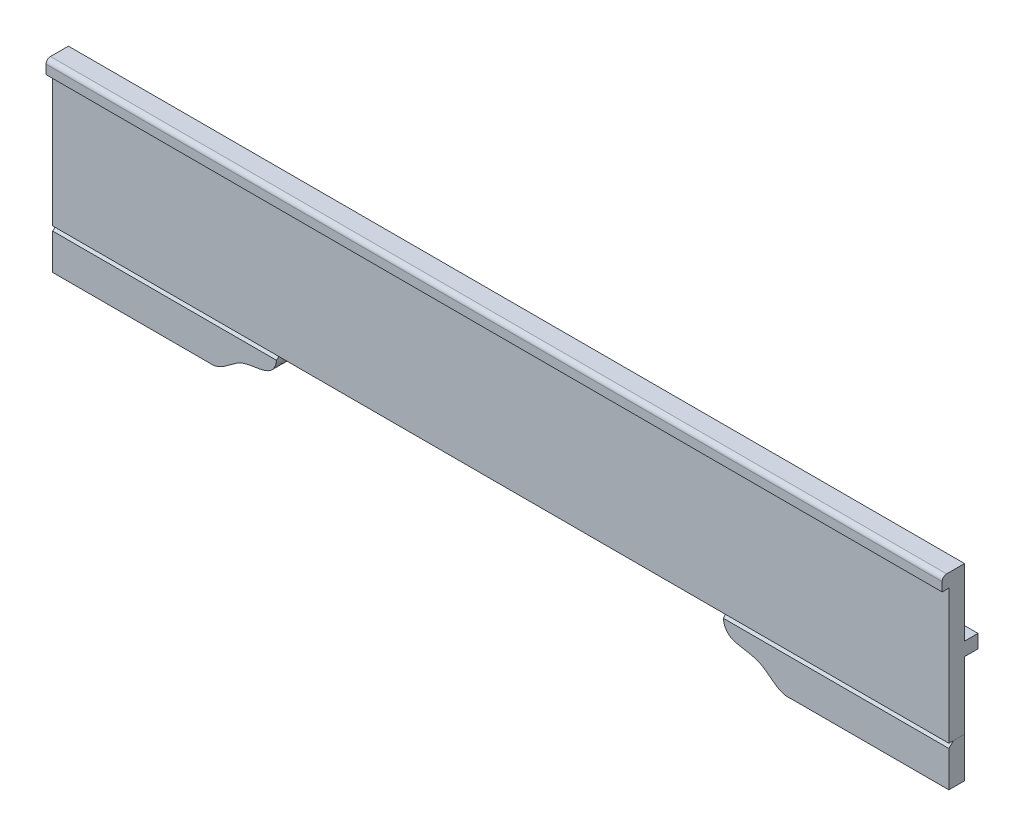
ISO-10303-21;
HEADER;
FILE_DESCRIPTION(('STEP AP214'),'2;1');
FILE_NAME('part.step','',(''),(''),'','','');
FILE_SCHEMA(('AUTOMOTIVE_DESIGN { 1 0 10303 214 1 1 1 1 }'));
ENDSEC;
DATA;
#1=APPLICATION_CONTEXT('core data for automotive mechanical design processes');
#2=APPLICATION_PROTOCOL_DEFINITION('international standard','automotive_design',2000,#1);
#3=PRODUCT_CONTEXT('',#1,'mechanical');
#4=PRODUCT('Part','Part','',(#3));
#5=PRODUCT_RELATED_PRODUCT_CATEGORY('part','',(#4));
#6=PRODUCT_DEFINITION_FORMATION('','',#4);
#7=PRODUCT_DEFINITION_CONTEXT('part definition',#1,'design');
#8=PRODUCT_DEFINITION('design','',#6,#7);
#9=PRODUCT_DEFINITION_SHAPE('','',#8);
#10=(LENGTH_UNIT() NAMED_UNIT(*) SI_UNIT(.MILLI.,.METRE.));
#11=(NAMED_UNIT(*) PLANE_ANGLE_UNIT() SI_UNIT($,.RADIAN.));
#12=(NAMED_UNIT(*) SI_UNIT($,.STERADIAN.) SOLID_ANGLE_UNIT());
#13=UNCERTAINTY_MEASURE_WITH_UNIT(LENGTH_MEASURE(1.E-05),#10,'distance_accuracy_value','');
#14=(GEOMETRIC_REPRESENTATION_CONTEXT(3) GLOBAL_UNCERTAINTY_ASSIGNED_CONTEXT((#13)) GLOBAL_UNIT_ASSIGNED_CONTEXT((#10,
#11,#12)) REPRESENTATION_CONTEXT('',''));
#15=CARTESIAN_POINT('',(0.,0.,0.));
#16=DIRECTION('',(0.,0.,1.));
#17=DIRECTION('',(1.,0.,0.));
#18=AXIS2_PLACEMENT_3D('',#15,#16,#17);
#19=CARTESIAN_POINT('',(0.,-330.,0.));
#20=DIRECTION('',(1.,0.,0.));
#21=DIRECTION('',(0.,1.,0.));
#22=AXIS2_PLACEMENT_3D('',#19,#20,#21);
#23=PLANE('',#22);
#24=DIRECTION('',(0.,0.,1.));
#25=VECTOR('',#24,1.);
#26=CARTESIAN_POINT('',(0.,-330.,0.));
#27=LINE('',#26,#25);
#28=CARTESIAN_POINT('',(0.,-330.,0.));
#29=VERTEX_POINT('',#28);
#30=CARTESIAN_POINT('',(0.,-330.,24.9999999999999));
#31=VERTEX_POINT('',#30);
#32=EDGE_CURVE('E96',#29,#31,#27,.T.);
#33=ORIENTED_EDGE('',*,*,#32,.T.);
#34=DIRECTION('',(0.,-0.707106781186544,0.707106781186551));
#35=VECTOR('',#34,1.);
#36=CARTESIAN_POINT('',(0.,-317.5,12.4999999999998));
#37=LINE('',#36,#35);
#38=CARTESIAN_POINT('',(0.,-340.,35.));
#39=VERTEX_POINT('',#38);
#40=EDGE_CURVE('E12',#31,#39,#37,.T.);
#41=ORIENTED_EDGE('',*,*,#40,.T.);
#42=DIRECTION('',(0.,1.,0.));
#43=VECTOR('',#42,1.);
#44=CARTESIAN_POINT('',(0.,-330.,35.));
#45=LINE('',#44,#43);
#46=CARTESIAN_POINT('',(0.,-420.,35.));
#47=VERTEX_POINT('',#46);
#48=EDGE_CURVE('E156',#47,#39,#45,.T.);
#49=ORIENTED_EDGE('',*,*,#48,.F.);
#50=DIRECTION('',(0.,0.,1.));
#51=VECTOR('',#50,1.);
#52=CARTESIAN_POINT('',(0.,-420.,0.));
#53=LINE('',#52,#51);
#54=CARTESIAN_POINT('',(0.,-420.,0.));
#55=VERTEX_POINT('',#54);
#56=EDGE_CURVE('E117',#55,#47,#53,.T.);
#57=ORIENTED_EDGE('',*,*,#56,.F.);
#58=DIRECTION('',(0.,1.,0.));
#59=VECTOR('',#58,1.);
#60=CARTESIAN_POINT('',(0.,-330.,0.));
#61=LINE('',#60,#59);
#62=EDGE_CURVE('E111',#55,#29,#61,.T.);
#63=ORIENTED_EDGE('',*,*,#62,.T.);
#64=EDGE_LOOP('',(#33,#41,#49,#57,#63));
#65=FACE_BOUND('',#64,.T.);
#66=ADVANCED_FACE('F51',(#65),#23,.T.);
#67=CARTESIAN_POINT('',(-353.966493072012,-420.,0.));
#68=DIRECTION('',(0.,-1.,0.));
#69=DIRECTION('',(0.,0.,-1.));
#70=AXIS2_PLACEMENT_3D('',#67,#68,#69);
#71=PLANE('',#70);
#72=DIRECTION('',(1.,0.,0.));
#73=VECTOR('',#72,1.);
#74=CARTESIAN_POINT('',(-353.966493072012,-420.,35.));
#75=LINE('',#74,#73);
#76=CARTESIAN_POINT('',(-353.966493072012,-420.,35.));
#77=VERTEX_POINT('',#76);
#78=EDGE_CURVE('E118',#77,#47,#75,.T.);
#79=ORIENTED_EDGE('',*,*,#78,.F.);
#80=DIRECTION('',(0.,0.,1.));
#81=VECTOR('',#80,1.);
#82=CARTESIAN_POINT('',(-353.966493072012,-420.,0.));
#83=LINE('',#82,#81);
#84=CARTESIAN_POINT('',(-353.966493072012,-420.,0.));
#85=VERTEX_POINT('',#84);
#86=EDGE_CURVE('E150',#85,#77,#83,.T.);
#87=ORIENTED_EDGE('',*,*,#86,.F.);
#88=DIRECTION('',(1.,0.,0.));
#89=VECTOR('',#88,1.);
#90=CARTESIAN_POINT('',(-353.966493072012,-420.,0.));
#91=LINE('',#90,#89);
#92=EDGE_CURVE('E104',#85,#55,#91,.T.);
#93=ORIENTED_EDGE('',*,*,#92,.T.);
#94=ORIENTED_EDGE('',*,*,#56,.T.);
#95=EDGE_LOOP('',(#79,#87,#93,#94));
#96=FACE_BOUND('',#95,.T.);
#97=ADVANCED_FACE('F138',(#96),#71,.T.);
#98=CARTESIAN_POINT('',(-503.966493072012,-330.,0.));
#99=CARTESIAN_POINT('',(-504.414495215681,-385.630170600178,0.));
#100=CARTESIAN_POINT('',(-422.34429833345,-358.815027435668,0.));
#101=CARTESIAN_POINT('',(-381.657255227392,-423.699197750509,0.));
#102=CARTESIAN_POINT('',(-353.966493072012,-420.,0.));
#103=B_SPLINE_CURVE_WITH_KNOTS('',3,(#98,#99,#100,#101,#102),.UNSPECIFIED.,.F.,.F.,(4,1,4),(0.,
0.572853034748376,1.),.UNSPECIFIED.);
#104=DIRECTION('',(0.,0.,1.));
#105=VECTOR('',#104,1.);
#106=SURFACE_OF_LINEAR_EXTRUSION('',#103,#105);
#107=CARTESIAN_POINT('',(-503.966493072012,-330.,35.));
#108=CARTESIAN_POINT('',(-504.414495215681,-385.630170600178,35.));
#109=CARTESIAN_POINT('',(-422.34429833345,-358.815027435668,35.));
#110=CARTESIAN_POINT('',(-381.657255227392,-423.699197750509,35.));
#111=CARTESIAN_POINT('',(-353.966493072012,-420.,35.));
#112=B_SPLINE_CURVE_WITH_KNOTS('',3,(#107,#108,#109,#110,#111),.UNSPECIFIED.,.F.,.F.,(4,1,4),
(0.,0.572853034748376,1.),.UNSPECIFIED.);
#113=CARTESIAN_POINT('',(-503.466209371858,-340.,35.));
#114=VERTEX_POINT('',#113);
#115=EDGE_CURVE('E121',#114,#77,#112,.T.);
#116=ORIENTED_EDGE('',*,*,#115,.F.);
#117=CARTESIAN_POINT('',(-503.466209371857,-340.,35.));
#118=CARTESIAN_POINT('',(-503.505150766661,-339.66731806229,34.6673180622897));
#119=CARTESIAN_POINT('',(-503.541536636363,-339.334488342683,34.3344883426829));
#120=CARTESIAN_POINT('',(-503.609398820621,-338.668694118556,33.6686941185556));
#121=CARTESIAN_POINT('',(-503.640876827888,-338.335729700393,33.3357297003933));
#122=CARTESIAN_POINT('',(-503.699144477672,-337.669676025937,32.6696760259372));
#123=CARTESIAN_POINT('',(-503.725935233593,-337.336586818176,32.3365868181762));
#124=CARTESIAN_POINT('',(-503.775031473123,-336.670291437057,31.6702914370569));
#125=CARTESIAN_POINT('',(-503.797337599369,-336.337085287321,31.3370852873211));
#126=CARTESIAN_POINT('',(-503.837655221583,-335.670563756144,30.6705637561444));
#127=CARTESIAN_POINT('',(-503.85566697791,-335.337248382553,30.3372483825532));
#128=CARTESIAN_POINT('',(-503.887573022776,-334.670536758577,29.6705367585768));
#129=CARTESIAN_POINT('',(-503.901467524652,-334.337140513278,29.3371405132783));
#130=CARTESIAN_POINT('',(-503.925307891221,-333.670246774644,28.6702467746436));
#131=CARTESIAN_POINT('',(-503.935253388937,-333.336749274779,28.3367492747787));
#132=CARTESIAN_POINT('',(-503.95135234281,-332.669654421464,27.669654421464));
#133=CARTESIAN_POINT('',(-503.957505180798,-332.336057060599,27.3360570605985));
#134=CARTESIAN_POINT('',(-503.966166351561,-331.668763950217,26.6687639502168));
#135=CARTESIAN_POINT('',(-503.968673863717,-331.335068195456,26.3350681954558));
#136=CARTESIAN_POINT('',(-503.970181063288,-330.667579101532,25.6675791015321));
#137=CARTESIAN_POINT('',(-503.969179767621,-330.333785761225,25.3337857612253));
#138=CARTESIAN_POINT('',(-503.966493072012,-330.,24.9999999999999));
#139=B_SPLINE_CURVE_WITH_KNOTS('',3,(#117,#118,#119,#120,#121,#122,#123,#124,#125,#126,#127,
#128,#129,#130,#131,#132,#133,#134,#135,#136,#137,#138),.UNSPECIFIED.,.F.,.F.,(4,2,2,2,2,2,2,2,
2,2,4),(0.,1.41626573545985,2.83204191790769,4.24748134094523,5.66271778969377,7.07786841328402,
8.49294569695597,9.90815445132504,11.3235938108181,12.7393517579547,14.1555063973891),.UNSPECIFIED.);
#140=CARTESIAN_POINT('',(-503.966493072012,-330.,24.9999999999999));
#141=VERTEX_POINT('',#140);
#142=EDGE_CURVE('E75',#114,#141,#139,.T.);
#143=ORIENTED_EDGE('',*,*,#142,.T.);
#144=DIRECTION('',(0.,0.,1.));
#145=VECTOR('',#144,1.);
#146=CARTESIAN_POINT('',(-503.966493072012,-330.,0.));
#147=LINE('',#146,#145);
#148=CARTESIAN_POINT('',(-503.966493072012,-330.,0.));
#149=VERTEX_POINT('',#148);
#150=EDGE_CURVE('E103',#149,#141,#147,.T.);
#151=ORIENTED_EDGE('',*,*,#150,.F.);
#152=EDGE_CURVE('E114',#149,#85,#103,.T.);
#153=ORIENTED_EDGE('',*,*,#152,.T.);
#154=ORIENTED_EDGE('',*,*,#86,.T.);
#155=EDGE_LOOP('',(#116,#143,#151,#153,#154));
#156=FACE_BOUND('',#155,.T.);
#157=ADVANCED_FACE('F133',(#156),#106,.T.);
#158=CARTESIAN_POINT('',(-503.966493072012,-330.,0.));
#159=DIRECTION('',(0.,1.,0.));
#160=DIRECTION('',(0.,0.,1.));
#161=AXIS2_PLACEMENT_3D('',#158,#159,#160);
#162=PLANE('',#161);
#163=ORIENTED_EDGE('',*,*,#150,.T.);
#164=DIRECTION('',(1.,0.,0.));
#165=VECTOR('',#164,1.);
#166=CARTESIAN_POINT('',(0.,-330.,24.9999999999999));
#167=LINE('',#166,#165);
#168=EDGE_CURVE('E61',#141,#31,#167,.T.);
#169=ORIENTED_EDGE('',*,*,#168,.T.);
#170=ORIENTED_EDGE('',*,*,#32,.F.);
#171=DIRECTION('',(-1.,0.,0.));
#172=VECTOR('',#171,1.);
#173=CARTESIAN_POINT('',(-503.966493072012,-330.,0.));
#174=LINE('',#173,#172);
#175=EDGE_CURVE('E99',#29,#149,#174,.T.);
#176=ORIENTED_EDGE('',*,*,#175,.T.);
#177=EDGE_LOOP('',(#163,#169,#170,#176));
#178=FACE_BOUND('',#177,.T.);
#179=ADVANCED_FACE('F98',(#178),#162,.T.);
#180=CARTESIAN_POINT('',(-437.255790960685,-380.631915248121,0.));
#181=DIRECTION('',(0.,0.,-1.));
#182=DIRECTION('',(-1.,0.,0.));
#183=AXIS2_PLACEMENT_3D('',#180,#181,#182);
#184=PLANE('',#183);
#185=ORIENTED_EDGE('',*,*,#62,.F.);
#186=ORIENTED_EDGE('',*,*,#92,.F.);
#187=ORIENTED_EDGE('',*,*,#152,.F.);
#188=ORIENTED_EDGE('',*,*,#175,.F.);
#189=EDGE_LOOP('',(#185,#186,#187,#188));
#190=FACE_BOUND('',#189,.T.);
#191=ADVANCED_FACE('F109',(#190),#184,.T.);
#192=CARTESIAN_POINT('',(-437.255790960685,-380.631915248121,35.));
#193=DIRECTION('',(0.,0.,-1.));
#194=DIRECTION('',(-1.,0.,0.));
#195=AXIS2_PLACEMENT_3D('',#192,#193,#194);
#196=PLANE('',#195);
#197=ORIENTED_EDGE('',*,*,#48,.T.);
#198=DIRECTION('',(-1.,0.,0.));
#199=VECTOR('',#198,1.);
#200=CARTESIAN_POINT('',(-503.966493072012,-340.,35.));
#201=LINE('',#200,#199);
#202=EDGE_CURVE('E146',#39,#114,#201,.T.);
#203=ORIENTED_EDGE('',*,*,#202,.T.);
#204=ORIENTED_EDGE('',*,*,#115,.T.);
#205=ORIENTED_EDGE('',*,*,#78,.T.);
#206=EDGE_LOOP('',(#197,#203,#204,#205));
#207=FACE_BOUND('',#206,.T.);
#208=ADVANCED_FACE('F163',(#207),#196,.F.);
#209=CARTESIAN_POINT('',(-437.255790960685,-340.,35.));
#210=DIRECTION('',(0.,0.707106781186551,0.707106781186543));
#211=DIRECTION('',(1.,0.,0.));
#212=AXIS2_PLACEMENT_3D('',#209,#210,#211);
#213=PLANE('',#212);
#214=ORIENTED_EDGE('',*,*,#40,.F.);
#215=ORIENTED_EDGE('',*,*,#168,.F.);
#216=ORIENTED_EDGE('',*,*,#142,.F.);
#217=ORIENTED_EDGE('',*,*,#202,.F.);
#218=EDGE_LOOP('',(#214,#215,#216,#217));
#219=FACE_BOUND('',#218,.T.);
#220=ADVANCED_FACE('F54',(#219),#213,.T.);
#221=CLOSED_SHELL('',(#66,#97,#157,#179,#191,#208,#220));
#222=MANIFOLD_SOLID_BREP('B2',#221);
#223=CARTESIAN_POINT('',(-2000.,-330.,0.));
#224=DIRECTION('',(-1.,0.,0.));
#225=DIRECTION('',(0.,0.,1.));
#226=AXIS2_PLACEMENT_3D('',#223,#224,#225);
#227=PLANE('',#226);
#228=DIRECTION('',(0.,-1.,0.));
#229=VECTOR('',#228,1.);
#230=CARTESIAN_POINT('',(-2000.,-330.,35.));
#231=LINE('',#230,#229);
#232=CARTESIAN_POINT('',(-2000.,-340.,35.));
#233=VERTEX_POINT('',#232);
#234=CARTESIAN_POINT('',(-2000.,-420.,35.));
#235=VERTEX_POINT('',#234);
#236=EDGE_CURVE('E348',#233,#235,#231,.T.);
#237=ORIENTED_EDGE('',*,*,#236,.F.);
#238=DIRECTION('',(0.,-0.707106781186544,0.707106781186551));
#239=VECTOR('',#238,1.);
#240=CARTESIAN_POINT('',(-2000.,-317.5,12.4999999999999));
#241=LINE('',#240,#239);
#242=CARTESIAN_POINT('',(-2000.,-330.,25.));
#243=VERTEX_POINT('',#242);
#244=EDGE_CURVE('E258',#233,#243,#241,.F.);
#245=ORIENTED_EDGE('',*,*,#244,.T.);
#246=DIRECTION('',(0.,0.,1.));
#247=VECTOR('',#246,1.);
#248=CARTESIAN_POINT('',(-2000.,-330.,0.));
#249=LINE('',#248,#247);
#250=CARTESIAN_POINT('',(-2000.,-330.,0.));
#251=VERTEX_POINT('',#250);
#252=EDGE_CURVE('E302',#251,#243,#249,.T.);
#253=ORIENTED_EDGE('',*,*,#252,.F.);
#254=DIRECTION('',(0.,-1.,0.));
#255=VECTOR('',#254,1.);
#256=CARTESIAN_POINT('',(-2000.,-330.,0.));
#257=LINE('',#256,#255);
#258=CARTESIAN_POINT('',(-2000.,-420.,0.));
#259=VERTEX_POINT('',#258);
#260=EDGE_CURVE('E297',#251,#259,#257,.T.);
#261=ORIENTED_EDGE('',*,*,#260,.T.);
#262=DIRECTION('',(0.,0.,1.));
#263=VECTOR('',#262,1.);
#264=CARTESIAN_POINT('',(-2000.,-420.,0.));
#265=LINE('',#264,#263);
#266=EDGE_CURVE('E282',#259,#235,#265,.T.);
#267=ORIENTED_EDGE('',*,*,#266,.T.);
#268=EDGE_LOOP('',(#237,#245,#253,#261,#267));
#269=FACE_BOUND('',#268,.T.);
#270=ADVANCED_FACE('F229',(#269),#227,.T.);
#271=CARTESIAN_POINT('',(-2000.,-330.,0.));
#272=DIRECTION('',(0.,1.,0.));
#273=DIRECTION('',(0.,0.,1.));
#274=AXIS2_PLACEMENT_3D('',#271,#272,#273);
#275=PLANE('',#274);
#276=ORIENTED_EDGE('',*,*,#252,.T.);
#277=DIRECTION('',(1.,0.,0.));
#278=VECTOR('',#277,1.);
#279=CARTESIAN_POINT('',(-2000.,-330.,25.));
#280=LINE('',#279,#278);
#281=CARTESIAN_POINT('',(-1500.,-330.,25.));
#282=VERTEX_POINT('',#281);
#283=EDGE_CURVE('E244',#243,#282,#280,.T.);
#284=ORIENTED_EDGE('',*,*,#283,.T.);
#285=DIRECTION('',(0.,0.,1.));
#286=VECTOR('',#285,1.);
#287=CARTESIAN_POINT('',(-1500.,-330.,0.));
#288=LINE('',#287,#286);
#289=CARTESIAN_POINT('',(-1500.,-330.,0.));
#290=VERTEX_POINT('',#289);
#291=EDGE_CURVE('E332',#290,#282,#288,.T.);
#292=ORIENTED_EDGE('',*,*,#291,.F.);
#293=DIRECTION('',(-1.,0.,0.));
#294=VECTOR('',#293,1.);
#295=CARTESIAN_POINT('',(-2000.,-330.,0.));
#296=LINE('',#295,#294);
#297=EDGE_CURVE('E290',#290,#251,#296,.T.);
#298=ORIENTED_EDGE('',*,*,#297,.T.);
#299=EDGE_LOOP('',(#276,#284,#292,#298));
#300=FACE_BOUND('',#299,.T.);
#301=ADVANCED_FACE('F321',(#300),#275,.T.);
#302=CARTESIAN_POINT('',(-1650.,-420.,0.));
#303=CARTESIAN_POINT('',(-1622.52446038278,-423.231832414367,0.));
#304=CARTESIAN_POINT('',(-1581.34295577677,-359.113372386989,0.));
#305=CARTESIAN_POINT('',(-1499.61965149037,-385.542451224288,0.));
#306=CARTESIAN_POINT('',(-1500.,-330.,0.));
#307=B_SPLINE_CURVE_WITH_KNOTS('',3,(#302,#303,#304,#305,#306),.UNSPECIFIED.,.F.,.F.,(4,1,4),
(0.,0.426688044879592,1.),.UNSPECIFIED.);
#308=DIRECTION('',(0.,0.,1.));
#309=VECTOR('',#308,1.);
#310=SURFACE_OF_LINEAR_EXTRUSION('',#307,#309);
#311=ORIENTED_EDGE('',*,*,#291,.T.);
#312=CARTESIAN_POINT('',(-1500.,-330.,25.));
#313=CARTESIAN_POINT('',(-1499.99771554374,-330.333797368368,25.3337973683676));
#314=CARTESIAN_POINT('',(-1499.99711686422,-330.667601300433,25.6676013004329));
#315=CARTESIAN_POINT('',(-1499.99942972792,-331.335109470269,26.3351094702693));
#316=CARTESIAN_POINT('',(-1500.00234028806,-331.668813709778,26.6688137097779));
#317=CARTESIAN_POINT('',(-1500.0118078002,-332.336121600971,27.3361216009711));
#318=CARTESIAN_POINT('',(-1500.01836393173,-332.669725258395,27.6697252583955));
#319=CARTESIAN_POINT('',(-1500.03526949613,-333.336830429504,28.3368304295039));
#320=CARTESIAN_POINT('',(-1500.04561831105,-333.670331950975,28.6703319509748));
#321=CARTESIAN_POINT('',(-1500.07026508347,-334.337231365541,29.3372313655409));
#322=CARTESIAN_POINT('',(-1500.08456267421,-334.670629265383,29.6706292653827));
#323=CARTESIAN_POINT('',(-1500.11727440312,-335.337341688865,30.3373416888654));
#324=CARTESIAN_POINT('',(-1500.13568875417,-335.670656207302,30.6706562073018));
#325=CARTESIAN_POINT('',(-1500.17681071017,-336.337173466726,31.3371734667258));
#326=CARTESIAN_POINT('',(-1500.19951857547,-336.670376199707,31.6703761997068));
#327=CARTESIAN_POINT('',(-1500.2494170505,-337.336662087538,32.3366620875381));
#328=CARTESIAN_POINT('',(-1500.2766083026,-337.669745218389,32.6697452183894));
#329=CARTESIAN_POINT('',(-1500.33567526517,-338.335783974483,33.3357839744828));
#330=CARTESIAN_POINT('',(-1500.36755208826,-338.668739550558,33.668739550558));
#331=CARTESIAN_POINT('',(-1500.43620970417,-339.334513217608,34.3345132176081));
#332=CARTESIAN_POINT('',(-1500.47299218804,-339.667331221297,34.6673312212972));
#333=CARTESIAN_POINT('',(-1500.5123287505,-340.,35.));
#334=B_SPLINE_CURVE_WITH_KNOTS('',3,(#312,#313,#314,#315,#316,#317,#318,#319,#320,#321,#322,
#323,#324,#325,#326,#327,#328,#329,#330,#331,#332,#333),.UNSPECIFIED.,.F.,.F.,(4,2,2,2,2,2,2,2,
2,2,4),(0.,1.41619752663572,2.83199840830506,4.2474807724138,5.66273261094606,7.07785305041993,
8.49304668540903,9.90832616302044,11.3238085903132,12.7396276717699,14.1559360710041),.UNSPECIFIED.);
#335=CARTESIAN_POINT('',(-1500.5123287505,-340.,35.));
#336=VERTEX_POINT('',#335);
#337=EDGE_CURVE('E49',#282,#336,#334,.T.);
#338=ORIENTED_EDGE('',*,*,#337,.T.);
#339=CARTESIAN_POINT('',(-1650.,-420.,35.));
#340=CARTESIAN_POINT('',(-1622.52446038278,-423.231832414367,35.));
#341=CARTESIAN_POINT('',(-1581.34295577677,-359.113372386989,35.));
#342=CARTESIAN_POINT('',(-1499.61965149037,-385.542451224288,35.));
#343=CARTESIAN_POINT('',(-1500.,-330.,35.));
#344=B_SPLINE_CURVE_WITH_KNOTS('',3,(#339,#340,#341,#342,#343),.UNSPECIFIED.,.F.,.F.,(4,1,4),
(0.,0.426688044879592,1.),.UNSPECIFIED.);
#345=CARTESIAN_POINT('',(-1650.,-420.,35.));
#346=VERTEX_POINT('',#345);
#347=EDGE_CURVE('E303',#346,#336,#344,.T.);
#348=ORIENTED_EDGE('',*,*,#347,.F.);
#349=DIRECTION('',(0.,0.,1.));
#350=VECTOR('',#349,1.);
#351=CARTESIAN_POINT('',(-1650.,-420.,0.));
#352=LINE('',#351,#350);
#353=CARTESIAN_POINT('',(-1650.,-420.,0.));
#354=VERTEX_POINT('',#353);
#355=EDGE_CURVE('E289',#354,#346,#352,.T.);
#356=ORIENTED_EDGE('',*,*,#355,.F.);
#357=EDGE_CURVE('E300',#354,#290,#307,.T.);
#358=ORIENTED_EDGE('',*,*,#357,.T.);
#359=EDGE_LOOP('',(#311,#338,#348,#356,#358));
#360=FACE_BOUND('',#359,.T.);
#361=ADVANCED_FACE('F316',(#360),#310,.T.);
#362=CARTESIAN_POINT('',(-2000.,-420.,0.));
#363=DIRECTION('',(0.,-1.,0.));
#364=DIRECTION('',(0.,0.,-1.));
#365=AXIS2_PLACEMENT_3D('',#362,#363,#364);
#366=PLANE('',#365);
#367=DIRECTION('',(1.,0.,0.));
#368=VECTOR('',#367,1.);
#369=CARTESIAN_POINT('',(-2000.,-420.,35.));
#370=LINE('',#369,#368);
#371=EDGE_CURVE('E287',#235,#346,#370,.T.);
#372=ORIENTED_EDGE('',*,*,#371,.F.);
#373=ORIENTED_EDGE('',*,*,#266,.F.);
#374=DIRECTION('',(1.,0.,0.));
#375=VECTOR('',#374,1.);
#376=CARTESIAN_POINT('',(-2000.,-420.,0.));
#377=LINE('',#376,#375);
#378=EDGE_CURVE('E285',#259,#354,#377,.T.);
#379=ORIENTED_EDGE('',*,*,#378,.T.);
#380=ORIENTED_EDGE('',*,*,#355,.T.);
#381=EDGE_LOOP('',(#372,#373,#379,#380));
#382=FACE_BOUND('',#381,.T.);
#383=ADVANCED_FACE('F284',(#382),#366,.T.);
#384=CARTESIAN_POINT('',(-1566.61104002383,-380.645323768434,0.));
#385=DIRECTION('',(0.,0.,1.));
#386=DIRECTION('',(1.,0.,0.));
#387=AXIS2_PLACEMENT_3D('',#384,#385,#386);
#388=PLANE('',#387);
#389=ORIENTED_EDGE('',*,*,#260,.F.);
#390=ORIENTED_EDGE('',*,*,#297,.F.);
#391=ORIENTED_EDGE('',*,*,#357,.F.);
#392=ORIENTED_EDGE('',*,*,#378,.F.);
#393=EDGE_LOOP('',(#389,#390,#391,#392));
#394=FACE_BOUND('',#393,.T.);
#395=ADVANCED_FACE('F295',(#394),#388,.F.);
#396=CARTESIAN_POINT('',(-1566.61104002383,-380.645323768434,35.));
#397=DIRECTION('',(0.,0.,1.));
#398=DIRECTION('',(1.,0.,0.));
#399=AXIS2_PLACEMENT_3D('',#396,#397,#398);
#400=PLANE('',#399);
#401=ORIENTED_EDGE('',*,*,#347,.T.);
#402=DIRECTION('',(-1.,0.,0.));
#403=VECTOR('',#402,1.);
#404=CARTESIAN_POINT('',(-1566.61104002383,-340.,35.));
#405=LINE('',#404,#403);
#406=EDGE_CURVE('E331',#336,#233,#405,.T.);
#407=ORIENTED_EDGE('',*,*,#406,.T.);
#408=ORIENTED_EDGE('',*,*,#236,.T.);
#409=ORIENTED_EDGE('',*,*,#371,.T.);
#410=EDGE_LOOP('',(#401,#407,#408,#409));
#411=FACE_BOUND('',#410,.T.);
#412=ADVANCED_FACE('F350',(#411),#400,.T.);
#413=CARTESIAN_POINT('',(-1566.61104002383,-340.,35.));
#414=DIRECTION('',(0.,-0.707106781186551,-0.707106781186544));
#415=DIRECTION('',(-1.,0.,0.));
#416=AXIS2_PLACEMENT_3D('',#413,#414,#415);
#417=PLANE('',#416);
#418=ORIENTED_EDGE('',*,*,#337,.F.);
#419=ORIENTED_EDGE('',*,*,#283,.F.);
#420=ORIENTED_EDGE('',*,*,#244,.F.);
#421=ORIENTED_EDGE('',*,*,#406,.F.);
#422=EDGE_LOOP('',(#418,#419,#420,#421));
#423=FACE_BOUND('',#422,.T.);
#424=ADVANCED_FACE('F232',(#423),#417,.F.);
#425=CLOSED_SHELL('',(#270,#301,#361,#383,#395,#412,#424));
#426=MANIFOLD_SOLID_BREP('B6',#425);
#427=CARTESIAN_POINT('',(0.,0.,0.));
#428=DIRECTION('',(0.,0.,-1.));
#429=DIRECTION('',(-1.,0.,0.));
#430=AXIS2_PLACEMENT_3D('',#427,#428,#429);
#431=PLANE('',#430);
#432=DIRECTION('',(1.,0.,0.));
#433=VECTOR('',#432,1.);
#434=CARTESIAN_POINT('',(0.,-150.,0.));
#435=LINE('',#434,#433);
#436=CARTESIAN_POINT('',(-2000.,-150.,0.));
#437=VERTEX_POINT('',#436);
#438=CARTESIAN_POINT('',(0.,-150.,0.));
#439=VERTEX_POINT('',#438);
#440=EDGE_CURVE('E415',#437,#439,#435,.T.);
#441=ORIENTED_EDGE('',*,*,#440,.F.);
#442=DIRECTION('',(0.,-1.,0.));
#443=VECTOR('',#442,1.);
#444=CARTESIAN_POINT('',(-2000.,0.,0.));
#445=LINE('',#444,#443);
#446=CARTESIAN_POINT('',(-2000.,0.,0.));
#447=VERTEX_POINT('',#446);
#448=EDGE_CURVE('E547',#447,#437,#445,.T.);
#449=ORIENTED_EDGE('',*,*,#448,.F.);
#450=DIRECTION('',(-1.,0.,0.));
#451=VECTOR('',#450,1.);
#452=CARTESIAN_POINT('',(0.,0.,0.));
#453=LINE('',#452,#451);
#454=CARTESIAN_POINT('',(0.,0.,0.));
#455=VERTEX_POINT('',#454);
#456=EDGE_CURVE('E556',#455,#447,#453,.T.);
#457=ORIENTED_EDGE('',*,*,#456,.F.);
#458=DIRECTION('',(0.,1.,0.));
#459=VECTOR('',#458,1.);
#460=CARTESIAN_POINT('',(0.,0.,0.));
#461=LINE('',#460,#459);
#462=EDGE_CURVE('E420',#439,#455,#461,.T.);
#463=ORIENTED_EDGE('',*,*,#462,.F.);
#464=EDGE_LOOP('',(#441,#449,#457,#463));
#465=FACE_BOUND('',#464,.T.);
#466=ADVANCED_FACE('F399',(#465),#431,.T.);
#467=CARTESIAN_POINT('',(0.,0.,50.));
#468=DIRECTION('',(-1.,0.,0.));
#469=DIRECTION('',(0.,0.,1.));
#470=AXIS2_PLACEMENT_3D('',#467,#468,#469);
#471=PLANE('',#470);
#472=DIRECTION('',(0.,0.,-1.));
#473=VECTOR('',#472,1.);
#474=CARTESIAN_POINT('',(0.,0.,50.));
#475=LINE('',#474,#473);
#476=CARTESIAN_POINT('',(0.,0.,40.));
#477=VERTEX_POINT('',#476);
#478=EDGE_CURVE('E573',#477,#455,#475,.T.);
#479=ORIENTED_EDGE('',*,*,#478,.F.);
#480=CARTESIAN_POINT('',(0.,-10.,40.));
#481=DIRECTION('',(-1.,0.,0.));
#482=DIRECTION('',(0.,0.,1.));
#483=AXIS2_PLACEMENT_3D('',#480,#481,#482);
#484=CIRCLE('',#483,10.);
#485=CARTESIAN_POINT('',(0.,-10.,50.));
#486=VERTEX_POINT('',#485);
#487=EDGE_CURVE('E227',#477,#486,#484,.F.);
#488=ORIENTED_EDGE('',*,*,#487,.T.);
#489=DIRECTION('',(0.,1.,0.));
#490=VECTOR('',#489,1.);
#491=CARTESIAN_POINT('',(0.,0.,50.));
#492=LINE('',#491,#490);
#493=CARTESIAN_POINT('',(0.,-30.,50.));
#494=VERTEX_POINT('',#493);
#495=EDGE_CURVE('E542',#494,#486,#492,.T.);
#496=ORIENTED_EDGE('',*,*,#495,.F.);
#497=DIRECTION('',(0.,0.,-1.));
#498=VECTOR('',#497,1.);
#499=CARTESIAN_POINT('',(0.,-30.,50.));
#500=LINE('',#499,#498);
#501=CARTESIAN_POINT('',(0.,-30.,35.));
#502=VERTEX_POINT('',#501);
#503=EDGE_CURVE('E553',#494,#502,#500,.T.);
#504=ORIENTED_EDGE('',*,*,#503,.T.);
#505=DIRECTION('',(0.,-1.,0.));
#506=VECTOR('',#505,1.);
#507=CARTESIAN_POINT('',(0.,-30.,35.));
#508=LINE('',#507,#506);
#509=CARTESIAN_POINT('',(0.,-330.,35.));
#510=VERTEX_POINT('',#509);
#511=EDGE_CURVE('E515',#502,#510,#508,.T.);
#512=ORIENTED_EDGE('',*,*,#511,.T.);
#513=DIRECTION('',(0.,0.,-1.));
#514=VECTOR('',#513,1.);
#515=CARTESIAN_POINT('',(0.,-330.,35.));
#516=LINE('',#515,#514);
#517=CARTESIAN_POINT('',(0.,-330.,0.));
#518=VERTEX_POINT('',#517);
#519=EDGE_CURVE('E534',#510,#518,#516,.T.);
#520=ORIENTED_EDGE('',*,*,#519,.T.);
#521=CARTESIAN_POINT('',(0.,-180.,0.));
#522=VERTEX_POINT('',#521);
#523=EDGE_CURVE('E508',#518,#522,#461,.T.);
#524=ORIENTED_EDGE('',*,*,#523,.T.);
#525=DIRECTION('',(0.,0.,1.));
#526=VECTOR('',#525,1.);
#527=CARTESIAN_POINT('',(0.,-180.,-30.));
#528=LINE('',#527,#526);
#529=CARTESIAN_POINT('',(0.,-180.,-30.));
#530=VERTEX_POINT('',#529);
#531=EDGE_CURVE('E486',#530,#522,#528,.T.);
#532=ORIENTED_EDGE('',*,*,#531,.F.);
#533=DIRECTION('',(0.,-1.,0.));
#534=VECTOR('',#533,1.);
#535=CARTESIAN_POINT('',(0.,-150.,-30.));
#536=LINE('',#535,#534);
#537=CARTESIAN_POINT('',(0.,-150.,-30.));
#538=VERTEX_POINT('',#537);
#539=EDGE_CURVE('E493',#538,#530,#536,.T.);
#540=ORIENTED_EDGE('',*,*,#539,.F.);
#541=DIRECTION('',(0.,0.,1.));
#542=VECTOR('',#541,1.);
#543=CARTESIAN_POINT('',(0.,-150.,-30.));
#544=LINE('',#543,#542);
#545=EDGE_CURVE('E620',#538,#439,#544,.T.);
#546=ORIENTED_EDGE('',*,*,#545,.T.);
#547=ORIENTED_EDGE('',*,*,#462,.T.);
#548=EDGE_LOOP('',(#479,#488,#496,#504,#512,#520,#524,#532,#540,#546,#547));
#549=FACE_BOUND('',#548,.T.);
#550=ADVANCED_FACE('F506',(#549),#471,.F.);
#551=CARTESIAN_POINT('',(0.,0.,50.));
#552=DIRECTION('',(0.,-1.,0.));
#553=DIRECTION('',(1.,0.,0.));
#554=AXIS2_PLACEMENT_3D('',#551,#552,#553);
#555=PLANE('',#554);
#556=DIRECTION('',(0.,0.,-1.));
#557=VECTOR('',#556,1.);
#558=CARTESIAN_POINT('',(-2000.,0.,50.));
#559=LINE('',#558,#557);
#560=CARTESIAN_POINT('',(-2000.,0.,40.));
#561=VERTEX_POINT('',#560);
#562=EDGE_CURVE('E570',#561,#447,#559,.T.);
#563=ORIENTED_EDGE('',*,*,#562,.F.);
#564=DIRECTION('',(-1.,0.,0.));
#565=VECTOR('',#564,1.);
#566=CARTESIAN_POINT('',(0.,0.,40.));
#567=LINE('',#566,#565);
#568=EDGE_CURVE('E408',#561,#477,#567,.F.);
#569=ORIENTED_EDGE('',*,*,#568,.T.);
#570=ORIENTED_EDGE('',*,*,#478,.T.);
#571=ORIENTED_EDGE('',*,*,#456,.T.);
#572=EDGE_LOOP('',(#563,#569,#570,#571));
#573=FACE_BOUND('',#572,.T.);
#574=ADVANCED_FACE('F587',(#573),#555,.F.);
#575=CARTESIAN_POINT('',(-2000.,0.,50.));
#576=DIRECTION('',(1.,0.,0.));
#577=DIRECTION('',(0.,0.,-1.));
#578=AXIS2_PLACEMENT_3D('',#575,#576,#577);
#579=PLANE('',#578);
#580=DIRECTION('',(0.,-1.,0.));
#581=VECTOR('',#580,1.);
#582=CARTESIAN_POINT('',(-2000.,0.,50.));
#583=LINE('',#582,#581);
#584=CARTESIAN_POINT('',(-2000.,-10.0000000000001,50.));
#585=VERTEX_POINT('',#584);
#586=CARTESIAN_POINT('',(-2000.,-29.9999999999999,50.));
#587=VERTEX_POINT('',#586);
#588=EDGE_CURVE('E546',#585,#587,#583,.T.);
#589=ORIENTED_EDGE('',*,*,#588,.F.);
#590=CARTESIAN_POINT('',(-2000.,-10.0000000000001,40.));
#591=DIRECTION('',(1.,0.,0.));
#592=DIRECTION('',(0.,0.,-1.));
#593=AXIS2_PLACEMENT_3D('',#590,#591,#592);
#594=CIRCLE('',#593,10.);
#595=EDGE_CURVE('E581',#585,#561,#594,.F.);
#596=ORIENTED_EDGE('',*,*,#595,.T.);
#597=ORIENTED_EDGE('',*,*,#562,.T.);
#598=ORIENTED_EDGE('',*,*,#448,.T.);
#599=DIRECTION('',(0.,0.,1.));
#600=VECTOR('',#599,1.);
#601=CARTESIAN_POINT('',(-2000.,-150.,-30.));
#602=LINE('',#601,#600);
#603=CARTESIAN_POINT('',(-2000.,-150.,-30.));
#604=VERTEX_POINT('',#603);
#605=EDGE_CURVE('E517',#604,#437,#602,.T.);
#606=ORIENTED_EDGE('',*,*,#605,.F.);
#607=DIRECTION('',(0.,1.,0.));
#608=VECTOR('',#607,1.);
#609=CARTESIAN_POINT('',(-2000.,-150.,-30.));
#610=LINE('',#609,#608);
#611=CARTESIAN_POINT('',(-2000.,-180.,-30.));
#612=VERTEX_POINT('',#611);
#613=EDGE_CURVE('E492',#612,#604,#610,.T.);
#614=ORIENTED_EDGE('',*,*,#613,.F.);
#615=DIRECTION('',(0.,0.,1.));
#616=VECTOR('',#615,1.);
#617=CARTESIAN_POINT('',(-2000.,-180.,-30.));
#618=LINE('',#617,#616);
#619=CARTESIAN_POINT('',(-2000.,-180.,0.));
#620=VERTEX_POINT('',#619);
#621=EDGE_CURVE('E488',#612,#620,#618,.T.);
#622=ORIENTED_EDGE('',*,*,#621,.T.);
#623=CARTESIAN_POINT('',(-2000.,-330.,0.));
#624=VERTEX_POINT('',#623);
#625=EDGE_CURVE('E560',#620,#624,#445,.T.);
#626=ORIENTED_EDGE('',*,*,#625,.T.);
#627=DIRECTION('',(0.,0.,-1.));
#628=VECTOR('',#627,1.);
#629=CARTESIAN_POINT('',(-2000.,-330.,35.));
#630=LINE('',#629,#628);
#631=CARTESIAN_POINT('',(-2000.,-330.,35.));
#632=VERTEX_POINT('',#631);
#633=EDGE_CURVE('E536',#632,#624,#630,.T.);
#634=ORIENTED_EDGE('',*,*,#633,.F.);
#635=DIRECTION('',(0.,1.,0.));
#636=VECTOR('',#635,1.);
#637=CARTESIAN_POINT('',(-2000.,-30.,35.));
#638=LINE('',#637,#636);
#639=CARTESIAN_POINT('',(-2000.,-30.,35.));
#640=VERTEX_POINT('',#639);
#641=EDGE_CURVE('E528',#632,#640,#638,.T.);
#642=ORIENTED_EDGE('',*,*,#641,.T.);
#643=DIRECTION('',(0.,0.,-1.));
#644=VECTOR('',#643,1.);
#645=CARTESIAN_POINT('',(-2000.,-29.9999999999999,50.));
#646=LINE('',#645,#644);
#647=EDGE_CURVE('E566',#587,#640,#646,.T.);
#648=ORIENTED_EDGE('',*,*,#647,.F.);
#649=EDGE_LOOP('',(#589,#596,#597,#598,#606,#614,#622,#626,#634,#642,#648));
#650=FACE_BOUND('',#649,.T.);
#651=ADVANCED_FACE('F597',(#650),#579,.F.);
#652=CARTESIAN_POINT('',(0.,-30.,50.));
#653=DIRECTION('',(0.,1.,0.));
#654=DIRECTION('',(-1.,0.,0.));
#655=AXIS2_PLACEMENT_3D('',#652,#653,#654);
#656=PLANE('',#655);
#657=ORIENTED_EDGE('',*,*,#647,.T.);
#658=DIRECTION('',(1.,0.,0.));
#659=VECTOR('',#658,1.);
#660=CARTESIAN_POINT('',(0.,-30.,35.));
#661=LINE('',#660,#659);
#662=EDGE_CURVE('E531',#640,#502,#661,.T.);
#663=ORIENTED_EDGE('',*,*,#662,.T.);
#664=ORIENTED_EDGE('',*,*,#503,.F.);
#665=DIRECTION('',(1.,0.,0.));
#666=VECTOR('',#665,1.);
#667=CARTESIAN_POINT('',(0.,-30.,50.));
#668=LINE('',#667,#666);
#669=EDGE_CURVE('E550',#587,#494,#668,.T.);
#670=ORIENTED_EDGE('',*,*,#669,.F.);
#671=EDGE_LOOP('',(#657,#663,#664,#670));
#672=FACE_BOUND('',#671,.T.);
#673=ADVANCED_FACE('F603',(#672),#656,.F.);
#674=CARTESIAN_POINT('',(0.,0.,50.));
#675=DIRECTION('',(0.,0.,-1.));
#676=DIRECTION('',(-1.,0.,0.));
#677=AXIS2_PLACEMENT_3D('',#674,#675,#676);
#678=PLANE('',#677);
#679=ORIENTED_EDGE('',*,*,#495,.T.);
#680=DIRECTION('',(-1.,0.,0.));
#681=VECTOR('',#680,1.);
#682=CARTESIAN_POINT('',(0.,-10.,50.));
#683=LINE('',#682,#681);
#684=EDGE_CURVE('E577',#486,#585,#683,.T.);
#685=ORIENTED_EDGE('',*,*,#684,.T.);
#686=ORIENTED_EDGE('',*,*,#588,.T.);
#687=ORIENTED_EDGE('',*,*,#669,.T.);
#688=EDGE_LOOP('',(#679,#685,#686,#687));
#689=FACE_BOUND('',#688,.T.);
#690=ADVANCED_FACE('F594',(#689),#678,.F.);
#691=DIRECTION('',(-1.,0.,0.));
#692=VECTOR('',#691,1.);
#693=CARTESIAN_POINT('',(0.,-180.,0.));
#694=LINE('',#693,#692);
#695=EDGE_CURVE('E612',#522,#620,#694,.T.);
#696=ORIENTED_EDGE('',*,*,#695,.F.);
#697=ORIENTED_EDGE('',*,*,#523,.F.);
#698=DIRECTION('',(-1.,0.,0.));
#699=VECTOR('',#698,1.);
#700=CARTESIAN_POINT('',(0.,-330.,0.));
#701=LINE('',#700,#699);
#702=EDGE_CURVE('E510',#518,#624,#701,.T.);
#703=ORIENTED_EDGE('',*,*,#702,.T.);
#704=ORIENTED_EDGE('',*,*,#625,.F.);
#705=EDGE_LOOP('',(#696,#697,#703,#704));
#706=FACE_BOUND('',#705,.T.);
#707=ADVANCED_FACE('F611',(#706),#431,.T.);
#708=CARTESIAN_POINT('',(0.,-330.,35.));
#709=DIRECTION('',(0.,-1.,0.));
#710=DIRECTION('',(0.,0.,-1.));
#711=AXIS2_PLACEMENT_3D('',#708,#709,#710);
#712=PLANE('',#711);
#713=ORIENTED_EDGE('',*,*,#702,.F.);
#714=ORIENTED_EDGE('',*,*,#519,.F.);
#715=DIRECTION('',(-1.,0.,0.));
#716=VECTOR('',#715,1.);
#717=CARTESIAN_POINT('',(0.,-330.,35.));
#718=LINE('',#717,#716);
#719=EDGE_CURVE('E524',#510,#632,#718,.T.);
#720=ORIENTED_EDGE('',*,*,#719,.T.);
#721=ORIENTED_EDGE('',*,*,#633,.T.);
#722=EDGE_LOOP('',(#713,#714,#720,#721));
#723=FACE_BOUND('',#722,.T.);
#724=ADVANCED_FACE('F609',(#723),#712,.T.);
#725=CARTESIAN_POINT('',(0.,0.,35.));
#726=DIRECTION('',(0.,0.,-1.));
#727=DIRECTION('',(-1.,0.,0.));
#728=AXIS2_PLACEMENT_3D('',#725,#726,#727);
#729=PLANE('',#728);
#730=ORIENTED_EDGE('',*,*,#511,.F.);
#731=ORIENTED_EDGE('',*,*,#662,.F.);
#732=ORIENTED_EDGE('',*,*,#641,.F.);
#733=ORIENTED_EDGE('',*,*,#719,.F.);
#734=EDGE_LOOP('',(#730,#731,#732,#733));
#735=FACE_BOUND('',#734,.T.);
#736=ADVANCED_FACE('F607',(#735),#729,.F.);
#737=CARTESIAN_POINT('',(0.,-10.,40.));
#738=DIRECTION('',(-1.,0.,0.));
#739=DIRECTION('',(0.,-1.,0.));
#740=AXIS2_PLACEMENT_3D('',#737,#738,#739);
#741=CYLINDRICAL_SURFACE('',#740,10.);
#742=ORIENTED_EDGE('',*,*,#487,.F.);
#743=ORIENTED_EDGE('',*,*,#568,.F.);
#744=ORIENTED_EDGE('',*,*,#595,.F.);
#745=ORIENTED_EDGE('',*,*,#684,.F.);
#746=EDGE_LOOP('',(#742,#743,#744,#745));
#747=FACE_BOUND('',#746,.T.);
#748=ADVANCED_FACE('F401',(#747),#741,.T.);
#749=CARTESIAN_POINT('',(0.,-180.,-30.));
#750=DIRECTION('',(0.,1.,0.));
#751=DIRECTION('',(0.,0.,1.));
#752=AXIS2_PLACEMENT_3D('',#749,#750,#751);
#753=PLANE('',#752);
#754=ORIENTED_EDGE('',*,*,#695,.T.);
#755=ORIENTED_EDGE('',*,*,#621,.F.);
#756=DIRECTION('',(-1.,0.,0.));
#757=VECTOR('',#756,1.);
#758=CARTESIAN_POINT('',(0.,-180.,-30.));
#759=LINE('',#758,#757);
#760=EDGE_CURVE('E481',#530,#612,#759,.T.);
#761=ORIENTED_EDGE('',*,*,#760,.F.);
#762=ORIENTED_EDGE('',*,*,#531,.T.);
#763=EDGE_LOOP('',(#754,#755,#761,#762));
#764=FACE_BOUND('',#763,.T.);
#765=ADVANCED_FACE('F484',(#764),#753,.F.);
#766=CARTESIAN_POINT('',(0.,-150.,-30.));
#767=DIRECTION('',(0.,-1.,0.));
#768=DIRECTION('',(0.,0.,-1.));
#769=AXIS2_PLACEMENT_3D('',#766,#767,#768);
#770=PLANE('',#769);
#771=ORIENTED_EDGE('',*,*,#440,.T.);
#772=ORIENTED_EDGE('',*,*,#545,.F.);
#773=DIRECTION('',(1.,0.,0.));
#774=VECTOR('',#773,1.);
#775=CARTESIAN_POINT('',(0.,-150.,-30.));
#776=LINE('',#775,#774);
#777=EDGE_CURVE('E498',#604,#538,#776,.T.);
#778=ORIENTED_EDGE('',*,*,#777,.F.);
#779=ORIENTED_EDGE('',*,*,#605,.T.);
#780=EDGE_LOOP('',(#771,#772,#778,#779));
#781=FACE_BOUND('',#780,.T.);
#782=ADVANCED_FACE('F626',(#781),#770,.F.);
#783=CARTESIAN_POINT('',(0.,0.,-30.));
#784=DIRECTION('',(0.,0.,-1.));
#785=DIRECTION('',(-1.,0.,0.));
#786=AXIS2_PLACEMENT_3D('',#783,#784,#785);
#787=PLANE('',#786);
#788=ORIENTED_EDGE('',*,*,#539,.T.);
#789=ORIENTED_EDGE('',*,*,#760,.T.);
#790=ORIENTED_EDGE('',*,*,#613,.T.);
#791=ORIENTED_EDGE('',*,*,#777,.T.);
#792=EDGE_LOOP('',(#788,#789,#790,#791));
#793=FACE_BOUND('',#792,.T.);
#794=ADVANCED_FACE('F496',(#793),#787,.T.);
#795=CLOSED_SHELL('',(#466,#550,#574,#651,#673,#690,#707,#724,#736,#748,#765,#782,#794));
#796=MANIFOLD_SOLID_BREP('B43',#795);
#797=ADVANCED_BREP_SHAPE_REPRESENTATION('',(#18,#222,#426,#796),#14);
#798=SHAPE_DEFINITION_REPRESENTATION(#9,#797);
ENDSEC;
END-ISO-10303-21;
